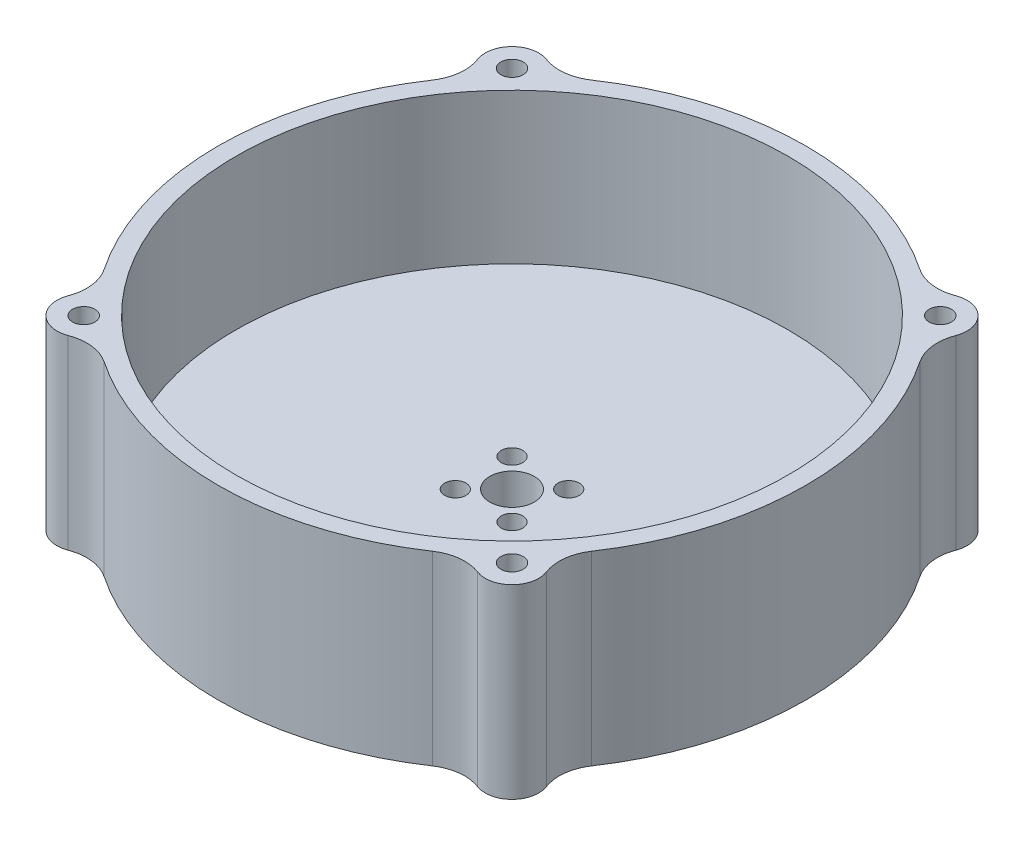
ISO-10303-21;
HEADER;
FILE_DESCRIPTION(('STEP AP214'),'2;1');
FILE_NAME('part.step','',(''),(''),'','','');
FILE_SCHEMA(('AUTOMOTIVE_DESIGN { 1 0 10303 214 1 1 1 1 }'));
ENDSEC;
DATA;
#1=APPLICATION_CONTEXT('core data for automotive mechanical design processes');
#2=APPLICATION_PROTOCOL_DEFINITION('international standard','automotive_design',2000,#1);
#3=PRODUCT_CONTEXT('',#1,'mechanical');
#4=PRODUCT('Part','Part','',(#3));
#5=PRODUCT_RELATED_PRODUCT_CATEGORY('part','',(#4));
#6=PRODUCT_DEFINITION_FORMATION('','',#4);
#7=PRODUCT_DEFINITION_CONTEXT('part definition',#1,'design');
#8=PRODUCT_DEFINITION('design','',#6,#7);
#9=PRODUCT_DEFINITION_SHAPE('','',#8);
#10=(LENGTH_UNIT() NAMED_UNIT(*) SI_UNIT(.MILLI.,.METRE.));
#11=(NAMED_UNIT(*) PLANE_ANGLE_UNIT() SI_UNIT($,.RADIAN.));
#12=(NAMED_UNIT(*) SI_UNIT($,.STERADIAN.) SOLID_ANGLE_UNIT());
#13=UNCERTAINTY_MEASURE_WITH_UNIT(LENGTH_MEASURE(1.E-05),#10,'distance_accuracy_value','');
#14=(GEOMETRIC_REPRESENTATION_CONTEXT(3) GLOBAL_UNCERTAINTY_ASSIGNED_CONTEXT((#13)) GLOBAL_UNIT_ASSIGNED_CONTEXT((#10,
#11,#12)) REPRESENTATION_CONTEXT('',''));
#15=CARTESIAN_POINT('',(0.,0.,0.));
#16=DIRECTION('',(0.,0.,1.));
#17=DIRECTION('',(1.,0.,0.));
#18=AXIS2_PLACEMENT_3D('',#15,#16,#17);
#19=CARTESIAN_POINT('',(0.,4.,0.));
#20=DIRECTION('',(0.,-1.,0.));
#21=DIRECTION('',(0.,0.,-1.));
#22=AXIS2_PLACEMENT_3D('',#19,#20,#21);
#23=CYLINDRICAL_SURFACE('',#22,33.);
#24=CARTESIAN_POINT('',(0.,0.,0.));
#25=DIRECTION('',(0.,1.,0.));
#26=DIRECTION('',(0.,0.,1.));
#27=AXIS2_PLACEMENT_3D('',#24,#25,#26);
#28=CIRCLE('',#27,33.);
#29=CARTESIAN_POINT('',(18.4243234866216,0.,-27.3778067795856));
#30=VERTEX_POINT('',#29);
#31=CARTESIAN_POINT('',(-18.4243234866216,0.,-27.3778067795856));
#32=VERTEX_POINT('',#31);
#33=EDGE_CURVE('E313',#30,#32,#28,.T.);
#34=ORIENTED_EDGE('',*,*,#33,.T.);
#35=DIRECTION('',(0.,-1.,0.));
#36=VECTOR('',#35,1.);
#37=CARTESIAN_POINT('',(-18.4243234866217,4.,-27.3778067795856));
#38=LINE('',#37,#36);
#39=CARTESIAN_POINT('',(-18.4243234866216,20.88,-27.3778067795856));
#40=VERTEX_POINT('',#39);
#41=EDGE_CURVE('E391',#32,#40,#38,.F.);
#42=ORIENTED_EDGE('',*,*,#41,.T.);
#43=CARTESIAN_POINT('',(0.,20.88,0.));
#44=DIRECTION('',(0.,1.,0.));
#45=DIRECTION('',(0.,0.,1.));
#46=AXIS2_PLACEMENT_3D('',#43,#44,#45);
#47=CIRCLE('',#46,33.);
#48=CARTESIAN_POINT('',(18.4243234866216,20.88,-27.3778067795856));
#49=VERTEX_POINT('',#48);
#50=EDGE_CURVE('E308',#49,#40,#47,.T.);
#51=ORIENTED_EDGE('',*,*,#50,.F.);
#52=DIRECTION('',(0.,-1.,0.));
#53=VECTOR('',#52,1.);
#54=CARTESIAN_POINT('',(18.4243234866216,4.,-27.3778067795856));
#55=LINE('',#54,#53);
#56=EDGE_CURVE('E330',#49,#30,#55,.T.);
#57=ORIENTED_EDGE('',*,*,#56,.T.);
#58=EDGE_LOOP('',(#34,#42,#51,#57));
#59=FACE_BOUND('',#58,.T.);
#60=ADVANCED_FACE('F46',(#59),#23,.T.);
#61=CARTESIAN_POINT('',(-27.3778067795854,20.88,-18.4243234866219));
#62=VERTEX_POINT('',#61);
#63=CARTESIAN_POINT('',(-27.3778067795854,20.88,18.4243234866219));
#64=VERTEX_POINT('',#63);
#65=EDGE_CURVE('E312',#62,#64,#47,.T.);
#66=ORIENTED_EDGE('',*,*,#65,.F.);
#67=DIRECTION('',(0.,-1.,0.));
#68=VECTOR('',#67,1.);
#69=CARTESIAN_POINT('',(-27.3778067795854,4.,-18.4243234866219));
#70=LINE('',#69,#68);
#71=CARTESIAN_POINT('',(-27.3778067795854,0.,-18.4243234866219));
#72=VERTEX_POINT('',#71);
#73=EDGE_CURVE('E384',#62,#72,#70,.T.);
#74=ORIENTED_EDGE('',*,*,#73,.T.);
#75=CARTESIAN_POINT('',(-27.3778067795854,0.,18.4243234866219));
#76=VERTEX_POINT('',#75);
#77=EDGE_CURVE('E316',#72,#76,#28,.T.);
#78=ORIENTED_EDGE('',*,*,#77,.T.);
#79=DIRECTION('',(0.,-1.,0.));
#80=VECTOR('',#79,1.);
#81=CARTESIAN_POINT('',(-27.3778067795854,4.,18.4243234866219));
#82=LINE('',#81,#80);
#83=EDGE_CURVE('E372',#76,#64,#82,.F.);
#84=ORIENTED_EDGE('',*,*,#83,.T.);
#85=EDGE_LOOP('',(#66,#74,#78,#84));
#86=FACE_BOUND('',#85,.T.);
#87=ADVANCED_FACE('F431',(#86),#23,.T.);
#88=CARTESIAN_POINT('',(-18.4243234866216,20.88,27.3778067795856));
#89=VERTEX_POINT('',#88);
#90=CARTESIAN_POINT('',(18.4243234866218,20.88,27.3778067795854));
#91=VERTEX_POINT('',#90);
#92=EDGE_CURVE('E449',#89,#91,#47,.T.);
#93=ORIENTED_EDGE('',*,*,#92,.F.);
#94=DIRECTION('',(0.,-1.,0.));
#95=VECTOR('',#94,1.);
#96=CARTESIAN_POINT('',(-18.4243234866216,4.,27.3778067795856));
#97=LINE('',#96,#95);
#98=CARTESIAN_POINT('',(-18.4243234866216,0.,27.3778067795856));
#99=VERTEX_POINT('',#98);
#100=EDGE_CURVE('E365',#89,#99,#97,.T.);
#101=ORIENTED_EDGE('',*,*,#100,.T.);
#102=CARTESIAN_POINT('',(18.4243234866218,0.,27.3778067795854));
#103=VERTEX_POINT('',#102);
#104=EDGE_CURVE('E426',#99,#103,#28,.T.);
#105=ORIENTED_EDGE('',*,*,#104,.T.);
#106=DIRECTION('',(0.,-1.,0.));
#107=VECTOR('',#106,1.);
#108=CARTESIAN_POINT('',(18.4243234866218,4.,27.3778067795854));
#109=LINE('',#108,#107);
#110=EDGE_CURVE('E353',#103,#91,#109,.F.);
#111=ORIENTED_EDGE('',*,*,#110,.T.);
#112=EDGE_LOOP('',(#93,#101,#105,#111));
#113=FACE_BOUND('',#112,.T.);
#114=ADVANCED_FACE('F451',(#113),#23,.T.);
#115=CARTESIAN_POINT('',(27.3778067795855,20.88,18.4243234866217));
#116=VERTEX_POINT('',#115);
#117=CARTESIAN_POINT('',(27.3778067795854,20.88,-18.4243234866219));
#118=VERTEX_POINT('',#117);
#119=EDGE_CURVE('E307',#116,#118,#47,.T.);
#120=ORIENTED_EDGE('',*,*,#119,.F.);
#121=DIRECTION('',(0.,-1.,0.));
#122=VECTOR('',#121,1.);
#123=CARTESIAN_POINT('',(27.3778067795855,4.,18.4243234866217));
#124=LINE('',#123,#122);
#125=CARTESIAN_POINT('',(27.3778067795855,0.,18.4243234866217));
#126=VERTEX_POINT('',#125);
#127=EDGE_CURVE('E346',#116,#126,#124,.T.);
#128=ORIENTED_EDGE('',*,*,#127,.T.);
#129=CARTESIAN_POINT('',(27.3778067795854,0.,-18.4243234866219));
#130=VERTEX_POINT('',#129);
#131=EDGE_CURVE('E311',#126,#130,#28,.T.);
#132=ORIENTED_EDGE('',*,*,#131,.T.);
#133=DIRECTION('',(0.,-1.,0.));
#134=VECTOR('',#133,1.);
#135=CARTESIAN_POINT('',(27.3778067795854,4.,-18.4243234866219));
#136=LINE('',#135,#134);
#137=EDGE_CURVE('E319',#130,#118,#136,.F.);
#138=ORIENTED_EDGE('',*,*,#137,.T.);
#139=EDGE_LOOP('',(#120,#128,#132,#138));
#140=FACE_BOUND('',#139,.T.);
#141=ADVANCED_FACE('F456',(#140),#23,.T.);
#142=CARTESIAN_POINT('',(0.,0.,0.));
#143=DIRECTION('',(0.,1.,0.));
#144=DIRECTION('',(0.,0.,1.));
#145=AXIS2_PLACEMENT_3D('',#142,#143,#144);
#146=PLANE('',#145);
#147=DIRECTION('',(0.,0.,1.));
#148=VECTOR('',#147,1.);
#149=CARTESIAN_POINT('',(13.5,0.,4.));
#150=LINE('',#149,#148);
#151=CARTESIAN_POINT('',(13.5,0.,-4.));
#152=VERTEX_POINT('',#151);
#153=CARTESIAN_POINT('',(13.5,0.,4.));
#154=VERTEX_POINT('',#153);
#155=EDGE_CURVE('E261',#152,#154,#150,.T.);
#156=ORIENTED_EDGE('',*,*,#155,.T.);
#157=CARTESIAN_POINT('',(15.,0.,4.));
#158=DIRECTION('',(0.,1.,0.));
#159=DIRECTION('',(0.,0.,1.));
#160=AXIS2_PLACEMENT_3D('',#157,#158,#159);
#161=CIRCLE('',#160,1.5);
#162=CARTESIAN_POINT('',(16.5,0.,4.));
#163=VERTEX_POINT('',#162);
#164=EDGE_CURVE('E251',#154,#163,#161,.T.);
#165=ORIENTED_EDGE('',*,*,#164,.T.);
#166=DIRECTION('',(0.,0.,-1.));
#167=VECTOR('',#166,1.);
#168=CARTESIAN_POINT('',(16.5,0.,4.));
#169=LINE('',#168,#167);
#170=CARTESIAN_POINT('',(16.5,0.,-4.));
#171=VERTEX_POINT('',#170);
#172=EDGE_CURVE('E254',#163,#171,#169,.T.);
#173=ORIENTED_EDGE('',*,*,#172,.T.);
#174=CARTESIAN_POINT('',(15.,0.,-4.));
#175=DIRECTION('',(0.,1.,0.));
#176=DIRECTION('',(0.,0.,1.));
#177=AXIS2_PLACEMENT_3D('',#174,#175,#176);
#178=CIRCLE('',#177,1.5);
#179=EDGE_CURVE('E258',#171,#152,#178,.T.);
#180=ORIENTED_EDGE('',*,*,#179,.T.);
#181=EDGE_LOOP('',(#156,#165,#173,#180));
#182=FACE_BOUND('',#181,.T.);
#183=CARTESIAN_POINT('',(0.,0.,0.));
#184=DIRECTION('',(0.,1.,0.));
#185=DIRECTION('',(0.,0.,1.));
#186=AXIS2_PLACEMENT_3D('',#183,#184,#185);
#187=CIRCLE('',#186,2.5);
#188=CARTESIAN_POINT('',(0.,0.,2.5));
#189=VERTEX_POINT('',#188);
#190=EDGE_CURVE('E283',#189,#189,#187,.T.);
#191=ORIENTED_EDGE('',*,*,#190,.T.);
#192=EDGE_LOOP('',(#191));
#193=FACE_BOUND('',#192,.T.);
#194=CARTESIAN_POINT('',(-3.18198051533946,0.,-3.18198051533946));
#195=DIRECTION('',(0.,-1.,0.));
#196=DIRECTION('',(0.,0.,-1.));
#197=AXIS2_PLACEMENT_3D('',#194,#195,#196);
#198=CIRCLE('',#197,1.2);
#199=CARTESIAN_POINT('',(-3.18198051533946,0.,-4.38198051533946));
#200=VERTEX_POINT('',#199);
#201=EDGE_CURVE('E286',#200,#200,#198,.T.);
#202=ORIENTED_EDGE('',*,*,#201,.F.);
#203=EDGE_LOOP('',(#202));
#204=FACE_BOUND('',#203,.T.);
#205=CARTESIAN_POINT('',(-3.18198051533946,0.,3.18198051533946));
#206=DIRECTION('',(0.,-1.,0.));
#207=DIRECTION('',(0.,0.,-1.));
#208=AXIS2_PLACEMENT_3D('',#205,#206,#207);
#209=CIRCLE('',#208,1.2);
#210=CARTESIAN_POINT('',(-3.18198051533946,0.,1.98198051533947));
#211=VERTEX_POINT('',#210);
#212=EDGE_CURVE('E292',#211,#211,#209,.T.);
#213=ORIENTED_EDGE('',*,*,#212,.F.);
#214=EDGE_LOOP('',(#213));
#215=FACE_BOUND('',#214,.T.);
#216=CARTESIAN_POINT('',(3.18198051533946,0.,3.18198051533946));
#217=DIRECTION('',(0.,-1.,0.));
#218=DIRECTION('',(0.,0.,-1.));
#219=AXIS2_PLACEMENT_3D('',#216,#217,#218);
#220=CIRCLE('',#219,1.2);
#221=CARTESIAN_POINT('',(3.18198051533946,0.,1.98198051533947));
#222=VERTEX_POINT('',#221);
#223=EDGE_CURVE('E296',#222,#222,#220,.T.);
#224=ORIENTED_EDGE('',*,*,#223,.F.);
#225=EDGE_LOOP('',(#224));
#226=FACE_BOUND('',#225,.T.);
#227=CARTESIAN_POINT('',(3.18198051533946,0.,-3.18198051533946));
#228=DIRECTION('',(0.,-1.,0.));
#229=DIRECTION('',(0.,0.,-1.));
#230=AXIS2_PLACEMENT_3D('',#227,#228,#229);
#231=CIRCLE('',#230,1.2);
#232=CARTESIAN_POINT('',(3.18198051533946,0.,-4.38198051533946));
#233=VERTEX_POINT('',#232);
#234=EDGE_CURVE('E300',#233,#233,#231,.T.);
#235=ORIENTED_EDGE('',*,*,#234,.F.);
#236=EDGE_LOOP('',(#235));
#237=FACE_BOUND('',#236,.T.);
#238=ORIENTED_EDGE('',*,*,#77,.F.);
#239=CARTESIAN_POINT('',(-31.5259593219468,0.,-21.2158876512616));
#240=DIRECTION('',(0.,1.,0.));
#241=DIRECTION('',(0.,0.,1.));
#242=AXIS2_PLACEMENT_3D('',#239,#240,#241);
#243=CIRCLE('',#242,5.);
#244=CARTESIAN_POINT('',(-26.8482538459441,0.,-22.9819769694373));
#245=VERTEX_POINT('',#244);
#246=EDGE_CURVE('E393',#72,#245,#243,.T.);
#247=ORIENTED_EDGE('',*,*,#246,.T.);
#248=CARTESIAN_POINT('',(-24.0416305603425,0.,-24.0416305603427));
#249=DIRECTION('',(0.,1.,0.));
#250=DIRECTION('',(1.,0.,0.));
#251=AXIS2_PLACEMENT_3D('',#248,#249,#250);
#252=CIRCLE('',#251,3.);
#253=CARTESIAN_POINT('',(-22.981976969437,0.,-26.8482538459443));
#254=VERTEX_POINT('',#253);
#255=EDGE_CURVE('E227',#254,#245,#252,.T.);
#256=ORIENTED_EDGE('',*,*,#255,.F.);
#257=CARTESIAN_POINT('',(-21.2158876512613,0.,-31.525959321947));
#258=DIRECTION('',(0.,1.,0.));
#259=DIRECTION('',(0.,0.,1.));
#260=AXIS2_PLACEMENT_3D('',#257,#258,#259);
#261=CIRCLE('',#260,5.);
#262=EDGE_CURVE('E11',#254,#32,#261,.T.);
#263=ORIENTED_EDGE('',*,*,#262,.T.);
#264=ORIENTED_EDGE('',*,*,#33,.F.);
#265=CARTESIAN_POINT('',(21.2158876512613,0.,-31.525959321947));
#266=DIRECTION('',(0.,1.,0.));
#267=DIRECTION('',(0.,0.,1.));
#268=AXIS2_PLACEMENT_3D('',#265,#266,#267);
#269=CIRCLE('',#268,5.);
#270=CARTESIAN_POINT('',(22.981976969437,0.,-26.8482538459444));
#271=VERTEX_POINT('',#270);
#272=EDGE_CURVE('E337',#30,#271,#269,.T.);
#273=ORIENTED_EDGE('',*,*,#272,.T.);
#274=CARTESIAN_POINT('',(24.0416305603425,0.,-24.0416305603427));
#275=DIRECTION('',(0.,1.,0.));
#276=DIRECTION('',(0.,0.,1.));
#277=AXIS2_PLACEMENT_3D('',#274,#275,#276);
#278=CIRCLE('',#277,3.);
#279=CARTESIAN_POINT('',(26.8482538459441,0.,-22.9819769694373));
#280=VERTEX_POINT('',#279);
#281=EDGE_CURVE('E245',#280,#271,#278,.T.);
#282=ORIENTED_EDGE('',*,*,#281,.F.);
#283=CARTESIAN_POINT('',(31.5259593219468,0.,-21.2158876512616));
#284=DIRECTION('',(0.,1.,0.));
#285=DIRECTION('',(0.,0.,1.));
#286=AXIS2_PLACEMENT_3D('',#283,#284,#285);
#287=CIRCLE('',#286,5.);
#288=EDGE_CURVE('E343',#280,#130,#287,.T.);
#289=ORIENTED_EDGE('',*,*,#288,.T.);
#290=ORIENTED_EDGE('',*,*,#131,.F.);
#291=CARTESIAN_POINT('',(31.525959321947,0.,21.2158876512614));
#292=DIRECTION('',(0.,1.,0.));
#293=DIRECTION('',(0.,0.,1.));
#294=AXIS2_PLACEMENT_3D('',#291,#292,#293);
#295=CIRCLE('',#294,5.);
#296=CARTESIAN_POINT('',(26.8482538459443,0.,22.9819769694371));
#297=VERTEX_POINT('',#296);
#298=EDGE_CURVE('E356',#126,#297,#295,.T.);
#299=ORIENTED_EDGE('',*,*,#298,.T.);
#300=CARTESIAN_POINT('',(24.0416305603427,0.,24.0416305603426));
#301=DIRECTION('',(0.,1.,0.));
#302=DIRECTION('',(-1.,0.,0.));
#303=AXIS2_PLACEMENT_3D('',#300,#301,#302);
#304=CIRCLE('',#303,3.);
#305=CARTESIAN_POINT('',(22.9819769694372,0.,26.8482538459442));
#306=VERTEX_POINT('',#305);
#307=EDGE_CURVE('E239',#306,#297,#304,.T.);
#308=ORIENTED_EDGE('',*,*,#307,.F.);
#309=CARTESIAN_POINT('',(21.2158876512615,0.,31.5259593219469));
#310=DIRECTION('',(0.,1.,0.));
#311=DIRECTION('',(0.,0.,1.));
#312=AXIS2_PLACEMENT_3D('',#309,#310,#311);
#313=CIRCLE('',#312,5.);
#314=EDGE_CURVE('E362',#306,#103,#313,.T.);
#315=ORIENTED_EDGE('',*,*,#314,.T.);
#316=ORIENTED_EDGE('',*,*,#104,.F.);
#317=CARTESIAN_POINT('',(-21.2158876512613,0.,31.525959321947));
#318=DIRECTION('',(0.,1.,0.));
#319=DIRECTION('',(0.,0.,1.));
#320=AXIS2_PLACEMENT_3D('',#317,#318,#319);
#321=CIRCLE('',#320,5.);
#322=CARTESIAN_POINT('',(-22.981976969437,0.,26.8482538459444));
#323=VERTEX_POINT('',#322);
#324=EDGE_CURVE('E375',#99,#323,#321,.T.);
#325=ORIENTED_EDGE('',*,*,#324,.T.);
#326=CARTESIAN_POINT('',(-24.0416305603425,0.,24.0416305603427));
#327=DIRECTION('',(0.,1.,0.));
#328=DIRECTION('',(0.,0.,-1.));
#329=AXIS2_PLACEMENT_3D('',#326,#327,#328);
#330=CIRCLE('',#329,3.);
#331=CARTESIAN_POINT('',(-26.8482538459441,0.,22.9819769694373));
#332=VERTEX_POINT('',#331);
#333=EDGE_CURVE('E233',#332,#323,#330,.T.);
#334=ORIENTED_EDGE('',*,*,#333,.F.);
#335=CARTESIAN_POINT('',(-31.5259593219468,0.,21.2158876512616));
#336=DIRECTION('',(0.,1.,0.));
#337=DIRECTION('',(0.,0.,1.));
#338=AXIS2_PLACEMENT_3D('',#335,#336,#337);
#339=CIRCLE('',#338,5.);
#340=EDGE_CURVE('E381',#332,#76,#339,.T.);
#341=ORIENTED_EDGE('',*,*,#340,.T.);
#342=EDGE_LOOP('',(#238,#247,#256,#263,#264,#273,#282,#289,#290,#299,#308,#315,#316,#325,#334,#341));
#343=FACE_BOUND('',#342,.T.);
#344=ADVANCED_FACE('F408',(#182,#193,#204,#215,#226,#237,#343),#146,.F.);
#345=CARTESIAN_POINT('',(0.,20.88,0.));
#346=DIRECTION('',(0.,1.,0.));
#347=DIRECTION('',(0.,0.,1.));
#348=AXIS2_PLACEMENT_3D('',#345,#346,#347);
#349=PLANE('',#348);
#350=CARTESIAN_POINT('',(24.0416305603427,20.88,24.0416305603426));
#351=DIRECTION('',(0.,1.,0.));
#352=DIRECTION('',(0.,0.,1.));
#353=AXIS2_PLACEMENT_3D('',#350,#351,#352);
#354=CIRCLE('',#353,1.25);
#355=CARTESIAN_POINT('',(24.0416305603427,20.88,25.2916305603426));
#356=VERTEX_POINT('',#355);
#357=EDGE_CURVE('E204',#356,#356,#354,.T.);
#358=ORIENTED_EDGE('',*,*,#357,.F.);
#359=EDGE_LOOP('',(#358));
#360=FACE_BOUND('',#359,.T.);
#361=CARTESIAN_POINT('',(-24.0416305603425,20.88,24.0416305603427));
#362=DIRECTION('',(0.,1.,0.));
#363=DIRECTION('',(0.,0.,1.));
#364=AXIS2_PLACEMENT_3D('',#361,#362,#363);
#365=CIRCLE('',#364,1.25);
#366=CARTESIAN_POINT('',(-24.0416305603425,20.88,25.2916305603427));
#367=VERTEX_POINT('',#366);
#368=EDGE_CURVE('E203',#367,#367,#365,.T.);
#369=ORIENTED_EDGE('',*,*,#368,.F.);
#370=EDGE_LOOP('',(#369));
#371=FACE_BOUND('',#370,.T.);
#372=CARTESIAN_POINT('',(-24.0416305603425,20.88,-24.0416305603427));
#373=DIRECTION('',(0.,1.,0.));
#374=DIRECTION('',(0.,0.,1.));
#375=AXIS2_PLACEMENT_3D('',#372,#373,#374);
#376=CIRCLE('',#375,1.25);
#377=CARTESIAN_POINT('',(-24.0416305603425,20.88,-22.7916305603427));
#378=VERTEX_POINT('',#377);
#379=EDGE_CURVE('E214',#378,#378,#376,.T.);
#380=ORIENTED_EDGE('',*,*,#379,.F.);
#381=EDGE_LOOP('',(#380));
#382=FACE_BOUND('',#381,.T.);
#383=CARTESIAN_POINT('',(24.0416305603425,20.88,-24.0416305603427));
#384=DIRECTION('',(0.,1.,0.));
#385=DIRECTION('',(0.,0.,1.));
#386=AXIS2_PLACEMENT_3D('',#383,#384,#385);
#387=CIRCLE('',#386,1.25);
#388=CARTESIAN_POINT('',(24.0416305603425,20.88,-22.7916305603427));
#389=VERTEX_POINT('',#388);
#390=EDGE_CURVE('E220',#389,#389,#387,.T.);
#391=ORIENTED_EDGE('',*,*,#390,.F.);
#392=EDGE_LOOP('',(#391));
#393=FACE_BOUND('',#392,.T.);
#394=ORIENTED_EDGE('',*,*,#50,.T.);
#395=CARTESIAN_POINT('',(-21.2158876512613,20.88,-31.525959321947));
#396=DIRECTION('',(0.,1.,0.));
#397=DIRECTION('',(0.,0.,1.));
#398=AXIS2_PLACEMENT_3D('',#395,#396,#397);
#399=CIRCLE('',#398,5.);
#400=CARTESIAN_POINT('',(-22.981976969437,20.88,-26.8482538459443));
#401=VERTEX_POINT('',#400);
#402=EDGE_CURVE('E54',#40,#401,#399,.F.);
#403=ORIENTED_EDGE('',*,*,#402,.T.);
#404=CARTESIAN_POINT('',(-24.0416305603425,20.88,-24.0416305603427));
#405=DIRECTION('',(0.,1.,0.));
#406=DIRECTION('',(1.,0.,0.));
#407=AXIS2_PLACEMENT_3D('',#404,#405,#406);
#408=CIRCLE('',#407,3.);
#409=CARTESIAN_POINT('',(-26.8482538459441,20.88,-22.9819769694373));
#410=VERTEX_POINT('',#409);
#411=EDGE_CURVE('E226',#401,#410,#408,.T.);
#412=ORIENTED_EDGE('',*,*,#411,.T.);
#413=CARTESIAN_POINT('',(-31.5259593219468,20.88,-21.2158876512616));
#414=DIRECTION('',(0.,1.,0.));
#415=DIRECTION('',(0.,0.,1.));
#416=AXIS2_PLACEMENT_3D('',#413,#414,#415);
#417=CIRCLE('',#416,5.);
#418=EDGE_CURVE('E395',#410,#62,#417,.F.);
#419=ORIENTED_EDGE('',*,*,#418,.T.);
#420=ORIENTED_EDGE('',*,*,#65,.T.);
#421=CARTESIAN_POINT('',(-31.5259593219468,20.88,21.2158876512616));
#422=DIRECTION('',(0.,1.,0.));
#423=DIRECTION('',(0.,0.,1.));
#424=AXIS2_PLACEMENT_3D('',#421,#422,#423);
#425=CIRCLE('',#424,5.);
#426=CARTESIAN_POINT('',(-26.8482538459441,20.88,22.9819769694373));
#427=VERTEX_POINT('',#426);
#428=EDGE_CURVE('E379',#64,#427,#425,.F.);
#429=ORIENTED_EDGE('',*,*,#428,.T.);
#430=CARTESIAN_POINT('',(-24.0416305603425,20.88,24.0416305603427));
#431=DIRECTION('',(0.,1.,0.));
#432=DIRECTION('',(0.,0.,-1.));
#433=AXIS2_PLACEMENT_3D('',#430,#431,#432);
#434=CIRCLE('',#433,3.);
#435=CARTESIAN_POINT('',(-22.981976969437,20.88,26.8482538459444));
#436=VERTEX_POINT('',#435);
#437=EDGE_CURVE('E230',#427,#436,#434,.T.);
#438=ORIENTED_EDGE('',*,*,#437,.T.);
#439=CARTESIAN_POINT('',(-21.2158876512613,20.88,31.525959321947));
#440=DIRECTION('',(0.,1.,0.));
#441=DIRECTION('',(0.,0.,1.));
#442=AXIS2_PLACEMENT_3D('',#439,#440,#441);
#443=CIRCLE('',#442,5.);
#444=EDGE_CURVE('E377',#436,#89,#443,.F.);
#445=ORIENTED_EDGE('',*,*,#444,.T.);
#446=ORIENTED_EDGE('',*,*,#92,.T.);
#447=CARTESIAN_POINT('',(21.2158876512615,20.88,31.5259593219469));
#448=DIRECTION('',(0.,1.,0.));
#449=DIRECTION('',(0.,0.,1.));
#450=AXIS2_PLACEMENT_3D('',#447,#448,#449);
#451=CIRCLE('',#450,5.);
#452=CARTESIAN_POINT('',(22.9819769694372,20.88,26.8482538459442));
#453=VERTEX_POINT('',#452);
#454=EDGE_CURVE('E360',#91,#453,#451,.F.);
#455=ORIENTED_EDGE('',*,*,#454,.T.);
#456=CARTESIAN_POINT('',(24.0416305603427,20.88,24.0416305603426));
#457=DIRECTION('',(0.,1.,0.));
#458=DIRECTION('',(-1.,0.,0.));
#459=AXIS2_PLACEMENT_3D('',#456,#457,#458);
#460=CIRCLE('',#459,3.);
#461=CARTESIAN_POINT('',(26.8482538459443,20.88,22.9819769694371));
#462=VERTEX_POINT('',#461);
#463=EDGE_CURVE('E236',#453,#462,#460,.T.);
#464=ORIENTED_EDGE('',*,*,#463,.T.);
#465=CARTESIAN_POINT('',(31.525959321947,20.88,21.2158876512614));
#466=DIRECTION('',(0.,1.,0.));
#467=DIRECTION('',(0.,0.,1.));
#468=AXIS2_PLACEMENT_3D('',#465,#466,#467);
#469=CIRCLE('',#468,5.);
#470=EDGE_CURVE('E358',#462,#116,#469,.F.);
#471=ORIENTED_EDGE('',*,*,#470,.T.);
#472=ORIENTED_EDGE('',*,*,#119,.T.);
#473=CARTESIAN_POINT('',(31.5259593219468,20.88,-21.2158876512616));
#474=DIRECTION('',(0.,1.,0.));
#475=DIRECTION('',(0.,0.,1.));
#476=AXIS2_PLACEMENT_3D('',#473,#474,#475);
#477=CIRCLE('',#476,5.);
#478=CARTESIAN_POINT('',(26.8482538459441,20.88,-22.9819769694373));
#479=VERTEX_POINT('',#478);
#480=EDGE_CURVE('E341',#118,#479,#477,.F.);
#481=ORIENTED_EDGE('',*,*,#480,.T.);
#482=CARTESIAN_POINT('',(24.0416305603425,20.88,-24.0416305603427));
#483=DIRECTION('',(0.,1.,0.));
#484=DIRECTION('',(0.,0.,1.));
#485=AXIS2_PLACEMENT_3D('',#482,#483,#484);
#486=CIRCLE('',#485,3.);
#487=CARTESIAN_POINT('',(22.981976969437,20.88,-26.8482538459444));
#488=VERTEX_POINT('',#487);
#489=EDGE_CURVE('E242',#479,#488,#486,.T.);
#490=ORIENTED_EDGE('',*,*,#489,.T.);
#491=CARTESIAN_POINT('',(21.2158876512613,20.88,-31.525959321947));
#492=DIRECTION('',(0.,1.,0.));
#493=DIRECTION('',(0.,0.,1.));
#494=AXIS2_PLACEMENT_3D('',#491,#492,#493);
#495=CIRCLE('',#494,5.);
#496=EDGE_CURVE('E339',#488,#49,#495,.F.);
#497=ORIENTED_EDGE('',*,*,#496,.T.);
#498=EDGE_LOOP('',(#394,#403,#412,#419,#420,#429,#438,#445,#446,#455,#464,#471,#472,#481,#490,#497));
#499=FACE_BOUND('',#498,.T.);
#500=CARTESIAN_POINT('',(0.,20.88,0.));
#501=DIRECTION('',(0.,1.,0.));
#502=DIRECTION('',(0.,0.,1.));
#503=AXIS2_PLACEMENT_3D('',#500,#501,#502);
#504=CIRCLE('',#503,31.);
#505=CARTESIAN_POINT('',(0.,20.88,31.));
#506=VERTEX_POINT('',#505);
#507=EDGE_CURVE('E304',#506,#506,#504,.T.);
#508=ORIENTED_EDGE('',*,*,#507,.F.);
#509=EDGE_LOOP('',(#508));
#510=FACE_BOUND('',#509,.T.);
#511=ADVANCED_FACE('F398',(#360,#371,#382,#393,#499,#510),#349,.T.);
#512=CARTESIAN_POINT('',(0.,20.88,0.));
#513=DIRECTION('',(0.,-1.,0.));
#514=DIRECTION('',(0.,0.,-1.));
#515=AXIS2_PLACEMENT_3D('',#512,#513,#514);
#516=CYLINDRICAL_SURFACE('',#515,31.);
#517=ORIENTED_EDGE('',*,*,#507,.T.);
#518=EDGE_LOOP('',(#517));
#519=FACE_BOUND('',#518,.T.);
#520=CARTESIAN_POINT('',(0.,4.,0.));
#521=DIRECTION('',(0.,1.,0.));
#522=DIRECTION('',(0.,0.,1.));
#523=AXIS2_PLACEMENT_3D('',#520,#521,#522);
#524=CIRCLE('',#523,31.);
#525=CARTESIAN_POINT('',(0.,4.,31.));
#526=VERTEX_POINT('',#525);
#527=EDGE_CURVE('E315',#526,#526,#524,.F.);
#528=ORIENTED_EDGE('',*,*,#527,.T.);
#529=EDGE_LOOP('',(#528));
#530=FACE_BOUND('',#529,.T.);
#531=ADVANCED_FACE('F641',(#519,#530),#516,.F.);
#532=CARTESIAN_POINT('',(0.,4.,0.));
#533=DIRECTION('',(0.,1.,0.));
#534=DIRECTION('',(0.,0.,1.));
#535=AXIS2_PLACEMENT_3D('',#532,#533,#534);
#536=PLANE('',#535);
#537=CARTESIAN_POINT('',(15.,4.,4.));
#538=DIRECTION('',(0.,1.,0.));
#539=DIRECTION('',(0.,0.,1.));
#540=AXIS2_PLACEMENT_3D('',#537,#538,#539);
#541=CIRCLE('',#540,1.5);
#542=CARTESIAN_POINT('',(13.5,4.,4.));
#543=VERTEX_POINT('',#542);
#544=CARTESIAN_POINT('',(16.5,4.,4.));
#545=VERTEX_POINT('',#544);
#546=EDGE_CURVE('E248',#543,#545,#541,.T.);
#547=ORIENTED_EDGE('',*,*,#546,.F.);
#548=DIRECTION('',(0.,0.,1.));
#549=VECTOR('',#548,1.);
#550=CARTESIAN_POINT('',(13.5,4.,4.));
#551=LINE('',#550,#549);
#552=CARTESIAN_POINT('',(13.5,4.,-4.));
#553=VERTEX_POINT('',#552);
#554=EDGE_CURVE('E255',#553,#543,#551,.T.);
#555=ORIENTED_EDGE('',*,*,#554,.F.);
#556=CARTESIAN_POINT('',(15.,4.,-4.));
#557=DIRECTION('',(0.,1.,0.));
#558=DIRECTION('',(0.,0.,1.));
#559=AXIS2_PLACEMENT_3D('',#556,#557,#558);
#560=CIRCLE('',#559,1.5);
#561=CARTESIAN_POINT('',(16.5,4.,-4.));
#562=VERTEX_POINT('',#561);
#563=EDGE_CURVE('E269',#562,#553,#560,.T.);
#564=ORIENTED_EDGE('',*,*,#563,.F.);
#565=DIRECTION('',(0.,0.,-1.));
#566=VECTOR('',#565,1.);
#567=CARTESIAN_POINT('',(16.5,4.,4.));
#568=LINE('',#567,#566);
#569=EDGE_CURVE('E266',#545,#562,#568,.T.);
#570=ORIENTED_EDGE('',*,*,#569,.F.);
#571=EDGE_LOOP('',(#547,#555,#564,#570));
#572=FACE_BOUND('',#571,.T.);
#573=CARTESIAN_POINT('',(0.,4.,0.));
#574=DIRECTION('',(0.,1.,0.));
#575=DIRECTION('',(0.,0.,1.));
#576=AXIS2_PLACEMENT_3D('',#573,#574,#575);
#577=CIRCLE('',#576,2.5);
#578=CARTESIAN_POINT('',(0.,4.,2.5));
#579=VERTEX_POINT('',#578);
#580=EDGE_CURVE('E276',#579,#579,#577,.T.);
#581=ORIENTED_EDGE('',*,*,#580,.F.);
#582=EDGE_LOOP('',(#581));
#583=FACE_BOUND('',#582,.T.);
#584=CARTESIAN_POINT('',(-3.18198051533946,4.,-3.18198051533946));
#585=DIRECTION('',(0.,1.,0.));
#586=DIRECTION('',(0.,0.,1.));
#587=AXIS2_PLACEMENT_3D('',#584,#585,#586);
#588=CIRCLE('',#587,1.2);
#589=CARTESIAN_POINT('',(-3.18198051533946,4.,-1.98198051533947));
#590=VERTEX_POINT('',#589);
#591=EDGE_CURVE('E291',#590,#590,#588,.T.);
#592=ORIENTED_EDGE('',*,*,#591,.F.);
#593=EDGE_LOOP('',(#592));
#594=FACE_BOUND('',#593,.T.);
#595=CARTESIAN_POINT('',(-3.18198051533946,4.,3.18198051533946));
#596=DIRECTION('',(0.,1.,0.));
#597=DIRECTION('',(0.,0.,1.));
#598=AXIS2_PLACEMENT_3D('',#595,#596,#597);
#599=CIRCLE('',#598,1.2);
#600=CARTESIAN_POINT('',(-3.18198051533946,4.,4.38198051533946));
#601=VERTEX_POINT('',#600);
#602=EDGE_CURVE('E295',#601,#601,#599,.T.);
#603=ORIENTED_EDGE('',*,*,#602,.F.);
#604=EDGE_LOOP('',(#603));
#605=FACE_BOUND('',#604,.T.);
#606=CARTESIAN_POINT('',(3.18198051533946,4.,3.18198051533946));
#607=DIRECTION('',(0.,1.,0.));
#608=DIRECTION('',(0.,0.,1.));
#609=AXIS2_PLACEMENT_3D('',#606,#607,#608);
#610=CIRCLE('',#609,1.2);
#611=CARTESIAN_POINT('',(3.18198051533946,4.,4.38198051533946));
#612=VERTEX_POINT('',#611);
#613=EDGE_CURVE('E299',#612,#612,#610,.T.);
#614=ORIENTED_EDGE('',*,*,#613,.F.);
#615=EDGE_LOOP('',(#614));
#616=FACE_BOUND('',#615,.T.);
#617=CARTESIAN_POINT('',(3.18198051533946,4.,-3.18198051533946));
#618=DIRECTION('',(0.,1.,0.));
#619=DIRECTION('',(0.,0.,1.));
#620=AXIS2_PLACEMENT_3D('',#617,#618,#619);
#621=CIRCLE('',#620,1.2);
#622=CARTESIAN_POINT('',(3.18198051533946,4.,-1.98198051533947));
#623=VERTEX_POINT('',#622);
#624=EDGE_CURVE('E303',#623,#623,#621,.T.);
#625=ORIENTED_EDGE('',*,*,#624,.F.);
#626=EDGE_LOOP('',(#625));
#627=FACE_BOUND('',#626,.T.);
#628=ORIENTED_EDGE('',*,*,#527,.F.);
#629=EDGE_LOOP('',(#628));
#630=FACE_BOUND('',#629,.T.);
#631=ADVANCED_FACE('F629',(#572,#583,#594,#605,#616,#627,#630),#536,.T.);
#632=CARTESIAN_POINT('',(3.18198051533946,0.,-3.18198051533946));
#633=DIRECTION('',(0.,-1.,0.));
#634=DIRECTION('',(0.,0.,-1.));
#635=AXIS2_PLACEMENT_3D('',#632,#633,#634);
#636=CYLINDRICAL_SURFACE('',#635,1.2);
#637=ORIENTED_EDGE('',*,*,#624,.T.);
#638=EDGE_LOOP('',(#637));
#639=FACE_BOUND('',#638,.T.);
#640=ORIENTED_EDGE('',*,*,#234,.T.);
#641=EDGE_LOOP('',(#640));
#642=FACE_BOUND('',#641,.T.);
#643=ADVANCED_FACE('F619',(#639,#642),#636,.F.);
#644=CARTESIAN_POINT('',(3.18198051533946,0.,3.18198051533946));
#645=DIRECTION('',(0.,-1.,0.));
#646=DIRECTION('',(0.,0.,-1.));
#647=AXIS2_PLACEMENT_3D('',#644,#645,#646);
#648=CYLINDRICAL_SURFACE('',#647,1.2);
#649=ORIENTED_EDGE('',*,*,#613,.T.);
#650=EDGE_LOOP('',(#649));
#651=FACE_BOUND('',#650,.T.);
#652=ORIENTED_EDGE('',*,*,#223,.T.);
#653=EDGE_LOOP('',(#652));
#654=FACE_BOUND('',#653,.T.);
#655=ADVANCED_FACE('F608',(#651,#654),#648,.F.);
#656=CARTESIAN_POINT('',(-3.18198051533946,0.,3.18198051533946));
#657=DIRECTION('',(0.,-1.,0.));
#658=DIRECTION('',(0.,0.,-1.));
#659=AXIS2_PLACEMENT_3D('',#656,#657,#658);
#660=CYLINDRICAL_SURFACE('',#659,1.2);
#661=ORIENTED_EDGE('',*,*,#602,.T.);
#662=EDGE_LOOP('',(#661));
#663=FACE_BOUND('',#662,.T.);
#664=ORIENTED_EDGE('',*,*,#212,.T.);
#665=EDGE_LOOP('',(#664));
#666=FACE_BOUND('',#665,.T.);
#667=ADVANCED_FACE('F597',(#663,#666),#660,.F.);
#668=CARTESIAN_POINT('',(-3.18198051533946,0.,-3.18198051533946));
#669=DIRECTION('',(0.,-1.,0.));
#670=DIRECTION('',(0.,0.,-1.));
#671=AXIS2_PLACEMENT_3D('',#668,#669,#670);
#672=CYLINDRICAL_SURFACE('',#671,1.2);
#673=ORIENTED_EDGE('',*,*,#591,.T.);
#674=EDGE_LOOP('',(#673));
#675=FACE_BOUND('',#674,.T.);
#676=ORIENTED_EDGE('',*,*,#201,.T.);
#677=EDGE_LOOP('',(#676));
#678=FACE_BOUND('',#677,.T.);
#679=ADVANCED_FACE('F586',(#675,#678),#672,.F.);
#680=CARTESIAN_POINT('',(0.,0.,0.));
#681=DIRECTION('',(0.,1.,0.));
#682=DIRECTION('',(0.,0.,1.));
#683=AXIS2_PLACEMENT_3D('',#680,#681,#682);
#684=CYLINDRICAL_SURFACE('',#683,2.5);
#685=ORIENTED_EDGE('',*,*,#190,.F.);
#686=EDGE_LOOP('',(#685));
#687=FACE_BOUND('',#686,.T.);
#688=ORIENTED_EDGE('',*,*,#580,.T.);
#689=EDGE_LOOP('',(#688));
#690=FACE_BOUND('',#689,.T.);
#691=ADVANCED_FACE('F575',(#687,#690),#684,.F.);
#692=CARTESIAN_POINT('',(15.,0.,4.));
#693=DIRECTION('',(0.,1.,0.));
#694=DIRECTION('',(0.,0.,1.));
#695=AXIS2_PLACEMENT_3D('',#692,#693,#694);
#696=CYLINDRICAL_SURFACE('',#695,1.5);
#697=ORIENTED_EDGE('',*,*,#546,.T.);
#698=DIRECTION('',(0.,1.,0.));
#699=VECTOR('',#698,1.);
#700=CARTESIAN_POINT('',(16.5,0.,4.));
#701=LINE('',#700,#699);
#702=EDGE_CURVE('E264',#163,#545,#701,.T.);
#703=ORIENTED_EDGE('',*,*,#702,.F.);
#704=ORIENTED_EDGE('',*,*,#164,.F.);
#705=DIRECTION('',(0.,1.,0.));
#706=VECTOR('',#705,1.);
#707=CARTESIAN_POINT('',(13.5,0.,4.));
#708=LINE('',#707,#706);
#709=EDGE_CURVE('E274',#154,#543,#708,.T.);
#710=ORIENTED_EDGE('',*,*,#709,.T.);
#711=EDGE_LOOP('',(#697,#703,#704,#710));
#712=FACE_BOUND('',#711,.T.);
#713=ADVANCED_FACE('F564',(#712),#696,.F.);
#714=CARTESIAN_POINT('',(13.5,0.,4.));
#715=DIRECTION('',(-1.,0.,0.));
#716=DIRECTION('',(0.,0.,1.));
#717=AXIS2_PLACEMENT_3D('',#714,#715,#716);
#718=PLANE('',#717);
#719=ORIENTED_EDGE('',*,*,#554,.T.);
#720=ORIENTED_EDGE('',*,*,#709,.F.);
#721=ORIENTED_EDGE('',*,*,#155,.F.);
#722=DIRECTION('',(0.,1.,0.));
#723=VECTOR('',#722,1.);
#724=CARTESIAN_POINT('',(13.5,0.,-4.));
#725=LINE('',#724,#723);
#726=EDGE_CURVE('E277',#152,#553,#725,.T.);
#727=ORIENTED_EDGE('',*,*,#726,.T.);
#728=EDGE_LOOP('',(#719,#720,#721,#727));
#729=FACE_BOUND('',#728,.T.);
#730=ADVANCED_FACE('F553',(#729),#718,.F.);
#731=CARTESIAN_POINT('',(15.,0.,-4.));
#732=DIRECTION('',(0.,1.,0.));
#733=DIRECTION('',(0.,0.,1.));
#734=AXIS2_PLACEMENT_3D('',#731,#732,#733);
#735=CYLINDRICAL_SURFACE('',#734,1.5);
#736=ORIENTED_EDGE('',*,*,#563,.T.);
#737=ORIENTED_EDGE('',*,*,#726,.F.);
#738=ORIENTED_EDGE('',*,*,#179,.F.);
#739=DIRECTION('',(0.,1.,0.));
#740=VECTOR('',#739,1.);
#741=CARTESIAN_POINT('',(16.5,0.,-4.));
#742=LINE('',#741,#740);
#743=EDGE_CURVE('E279',#171,#562,#742,.T.);
#744=ORIENTED_EDGE('',*,*,#743,.T.);
#745=EDGE_LOOP('',(#736,#737,#738,#744));
#746=FACE_BOUND('',#745,.T.);
#747=ADVANCED_FACE('F541',(#746),#735,.F.);
#748=CARTESIAN_POINT('',(16.5,0.,4.));
#749=DIRECTION('',(1.,0.,0.));
#750=DIRECTION('',(0.,0.,-1.));
#751=AXIS2_PLACEMENT_3D('',#748,#749,#750);
#752=PLANE('',#751);
#753=ORIENTED_EDGE('',*,*,#569,.T.);
#754=ORIENTED_EDGE('',*,*,#743,.F.);
#755=ORIENTED_EDGE('',*,*,#172,.F.);
#756=ORIENTED_EDGE('',*,*,#702,.T.);
#757=EDGE_LOOP('',(#753,#754,#755,#756));
#758=FACE_BOUND('',#757,.T.);
#759=ADVANCED_FACE('F530',(#758),#752,.F.);
#760=CARTESIAN_POINT('',(24.0416305603425,0.,-24.0416305603427));
#761=DIRECTION('',(0.,1.,0.));
#762=DIRECTION('',(0.,0.,1.));
#763=AXIS2_PLACEMENT_3D('',#760,#761,#762);
#764=CYLINDRICAL_SURFACE('',#763,3.);
#765=ORIENTED_EDGE('',*,*,#281,.T.);
#766=DIRECTION('',(0.,1.,0.));
#767=VECTOR('',#766,1.);
#768=CARTESIAN_POINT('',(22.981976969437,0.,-26.8482538459444));
#769=LINE('',#768,#767);
#770=EDGE_CURVE('E335',#271,#488,#769,.T.);
#771=ORIENTED_EDGE('',*,*,#770,.T.);
#772=ORIENTED_EDGE('',*,*,#489,.F.);
#773=DIRECTION('',(0.,1.,0.));
#774=VECTOR('',#773,1.);
#775=CARTESIAN_POINT('',(26.8482538459441,0.,-22.9819769694373));
#776=LINE('',#775,#774);
#777=EDGE_CURVE('E333',#479,#280,#776,.F.);
#778=ORIENTED_EDGE('',*,*,#777,.T.);
#779=EDGE_LOOP('',(#765,#771,#772,#778));
#780=FACE_BOUND('',#779,.T.);
#781=ADVANCED_FACE('F414',(#780),#764,.T.);
#782=CARTESIAN_POINT('',(21.2158876512613,0.,-31.525959321947));
#783=DIRECTION('',(0.,1.,0.));
#784=DIRECTION('',(0.,0.,1.));
#785=AXIS2_PLACEMENT_3D('',#782,#783,#784);
#786=CYLINDRICAL_SURFACE('',#785,5.);
#787=ORIENTED_EDGE('',*,*,#496,.F.);
#788=ORIENTED_EDGE('',*,*,#770,.F.);
#789=ORIENTED_EDGE('',*,*,#272,.F.);
#790=ORIENTED_EDGE('',*,*,#56,.F.);
#791=EDGE_LOOP('',(#787,#788,#789,#790));
#792=FACE_BOUND('',#791,.T.);
#793=ADVANCED_FACE('F418',(#792),#786,.F.);
#794=CARTESIAN_POINT('',(31.5259593219468,0.,-21.2158876512616));
#795=DIRECTION('',(0.,-1.,0.));
#796=DIRECTION('',(0.,0.,-1.));
#797=AXIS2_PLACEMENT_3D('',#794,#795,#796);
#798=CYLINDRICAL_SURFACE('',#797,5.);
#799=ORIENTED_EDGE('',*,*,#288,.F.);
#800=ORIENTED_EDGE('',*,*,#777,.F.);
#801=ORIENTED_EDGE('',*,*,#480,.F.);
#802=ORIENTED_EDGE('',*,*,#137,.F.);
#803=EDGE_LOOP('',(#799,#800,#801,#802));
#804=FACE_BOUND('',#803,.T.);
#805=ADVANCED_FACE('F421',(#804),#798,.F.);
#806=CARTESIAN_POINT('',(24.0416305603427,0.,24.0416305603426));
#807=DIRECTION('',(0.,1.,0.));
#808=DIRECTION('',(0.,0.,1.));
#809=AXIS2_PLACEMENT_3D('',#806,#807,#808);
#810=CYLINDRICAL_SURFACE('',#809,3.);
#811=ORIENTED_EDGE('',*,*,#307,.T.);
#812=DIRECTION('',(0.,1.,0.));
#813=VECTOR('',#812,1.);
#814=CARTESIAN_POINT('',(26.8482538459443,0.,22.9819769694371));
#815=LINE('',#814,#813);
#816=EDGE_CURVE('E351',#297,#462,#815,.T.);
#817=ORIENTED_EDGE('',*,*,#816,.T.);
#818=ORIENTED_EDGE('',*,*,#463,.F.);
#819=DIRECTION('',(0.,1.,0.));
#820=VECTOR('',#819,1.);
#821=CARTESIAN_POINT('',(22.9819769694372,0.,26.8482538459442));
#822=LINE('',#821,#820);
#823=EDGE_CURVE('E349',#453,#306,#822,.F.);
#824=ORIENTED_EDGE('',*,*,#823,.T.);
#825=EDGE_LOOP('',(#811,#817,#818,#824));
#826=FACE_BOUND('',#825,.T.);
#827=ADVANCED_FACE('F462',(#826),#810,.T.);
#828=CARTESIAN_POINT('',(-24.0416305603425,0.,24.0416305603427));
#829=DIRECTION('',(0.,1.,0.));
#830=DIRECTION('',(0.,0.,1.));
#831=AXIS2_PLACEMENT_3D('',#828,#829,#830);
#832=CYLINDRICAL_SURFACE('',#831,3.);
#833=ORIENTED_EDGE('',*,*,#333,.T.);
#834=DIRECTION('',(0.,1.,0.));
#835=VECTOR('',#834,1.);
#836=CARTESIAN_POINT('',(-22.981976969437,0.,26.8482538459444));
#837=LINE('',#836,#835);
#838=EDGE_CURVE('E370',#323,#436,#837,.T.);
#839=ORIENTED_EDGE('',*,*,#838,.T.);
#840=ORIENTED_EDGE('',*,*,#437,.F.);
#841=DIRECTION('',(0.,1.,0.));
#842=VECTOR('',#841,1.);
#843=CARTESIAN_POINT('',(-26.8482538459441,0.,22.9819769694373));
#844=LINE('',#843,#842);
#845=EDGE_CURVE('E368',#427,#332,#844,.F.);
#846=ORIENTED_EDGE('',*,*,#845,.T.);
#847=EDGE_LOOP('',(#833,#839,#840,#846));
#848=FACE_BOUND('',#847,.T.);
#849=ADVANCED_FACE('F443',(#848),#832,.T.);
#850=CARTESIAN_POINT('',(-24.0416305603425,0.,-24.0416305603427));
#851=DIRECTION('',(0.,1.,0.));
#852=DIRECTION('',(0.,0.,1.));
#853=AXIS2_PLACEMENT_3D('',#850,#851,#852);
#854=CYLINDRICAL_SURFACE('',#853,3.);
#855=ORIENTED_EDGE('',*,*,#255,.T.);
#856=DIRECTION('',(0.,1.,0.));
#857=VECTOR('',#856,1.);
#858=CARTESIAN_POINT('',(-26.8482538459441,0.,-22.9819769694373));
#859=LINE('',#858,#857);
#860=EDGE_CURVE('E389',#245,#410,#859,.T.);
#861=ORIENTED_EDGE('',*,*,#860,.T.);
#862=ORIENTED_EDGE('',*,*,#411,.F.);
#863=DIRECTION('',(0.,1.,0.));
#864=VECTOR('',#863,1.);
#865=CARTESIAN_POINT('',(-22.981976969437,0.,-26.8482538459443));
#866=LINE('',#865,#864);
#867=EDGE_CURVE('E387',#401,#254,#866,.F.);
#868=ORIENTED_EDGE('',*,*,#867,.T.);
#869=EDGE_LOOP('',(#855,#861,#862,#868));
#870=FACE_BOUND('',#869,.T.);
#871=ADVANCED_FACE('F403',(#870),#854,.T.);
#872=CARTESIAN_POINT('',(31.525959321947,0.,21.2158876512614));
#873=DIRECTION('',(0.,1.,0.));
#874=DIRECTION('',(0.,0.,1.));
#875=AXIS2_PLACEMENT_3D('',#872,#873,#874);
#876=CYLINDRICAL_SURFACE('',#875,5.);
#877=ORIENTED_EDGE('',*,*,#470,.F.);
#878=ORIENTED_EDGE('',*,*,#816,.F.);
#879=ORIENTED_EDGE('',*,*,#298,.F.);
#880=ORIENTED_EDGE('',*,*,#127,.F.);
#881=EDGE_LOOP('',(#877,#878,#879,#880));
#882=FACE_BOUND('',#881,.T.);
#883=ADVANCED_FACE('F458',(#882),#876,.F.);
#884=CARTESIAN_POINT('',(21.2158876512615,0.,31.5259593219469));
#885=DIRECTION('',(0.,-1.,0.));
#886=DIRECTION('',(0.,0.,-1.));
#887=AXIS2_PLACEMENT_3D('',#884,#885,#886);
#888=CYLINDRICAL_SURFACE('',#887,5.);
#889=ORIENTED_EDGE('',*,*,#314,.F.);
#890=ORIENTED_EDGE('',*,*,#823,.F.);
#891=ORIENTED_EDGE('',*,*,#454,.F.);
#892=ORIENTED_EDGE('',*,*,#110,.F.);
#893=EDGE_LOOP('',(#889,#890,#891,#892));
#894=FACE_BOUND('',#893,.T.);
#895=ADVANCED_FACE('F466',(#894),#888,.F.);
#896=CARTESIAN_POINT('',(-21.2158876512613,0.,31.525959321947));
#897=DIRECTION('',(0.,1.,0.));
#898=DIRECTION('',(0.,0.,1.));
#899=AXIS2_PLACEMENT_3D('',#896,#897,#898);
#900=CYLINDRICAL_SURFACE('',#899,5.);
#901=ORIENTED_EDGE('',*,*,#444,.F.);
#902=ORIENTED_EDGE('',*,*,#838,.F.);
#903=ORIENTED_EDGE('',*,*,#324,.F.);
#904=ORIENTED_EDGE('',*,*,#100,.F.);
#905=EDGE_LOOP('',(#901,#902,#903,#904));
#906=FACE_BOUND('',#905,.T.);
#907=ADVANCED_FACE('F446',(#906),#900,.F.);
#908=CARTESIAN_POINT('',(-31.5259593219468,0.,21.2158876512616));
#909=DIRECTION('',(0.,-1.,0.));
#910=DIRECTION('',(0.,0.,-1.));
#911=AXIS2_PLACEMENT_3D('',#908,#909,#910);
#912=CYLINDRICAL_SURFACE('',#911,5.);
#913=ORIENTED_EDGE('',*,*,#340,.F.);
#914=ORIENTED_EDGE('',*,*,#845,.F.);
#915=ORIENTED_EDGE('',*,*,#428,.F.);
#916=ORIENTED_EDGE('',*,*,#83,.F.);
#917=EDGE_LOOP('',(#913,#914,#915,#916));
#918=FACE_BOUND('',#917,.T.);
#919=ADVANCED_FACE('F439',(#918),#912,.F.);
#920=CARTESIAN_POINT('',(-31.5259593219468,0.,-21.2158876512616));
#921=DIRECTION('',(0.,1.,0.));
#922=DIRECTION('',(0.,0.,1.));
#923=AXIS2_PLACEMENT_3D('',#920,#921,#922);
#924=CYLINDRICAL_SURFACE('',#923,5.);
#925=ORIENTED_EDGE('',*,*,#418,.F.);
#926=ORIENTED_EDGE('',*,*,#860,.F.);
#927=ORIENTED_EDGE('',*,*,#246,.F.);
#928=ORIENTED_EDGE('',*,*,#73,.F.);
#929=EDGE_LOOP('',(#925,#926,#927,#928));
#930=FACE_BOUND('',#929,.T.);
#931=ADVANCED_FACE('F836',(#930),#924,.F.);
#932=CARTESIAN_POINT('',(-21.2158876512613,0.,-31.525959321947));
#933=DIRECTION('',(0.,-1.,0.));
#934=DIRECTION('',(0.,0.,-1.));
#935=AXIS2_PLACEMENT_3D('',#932,#933,#934);
#936=CYLINDRICAL_SURFACE('',#935,5.);
#937=ORIENTED_EDGE('',*,*,#262,.F.);
#938=ORIENTED_EDGE('',*,*,#867,.F.);
#939=ORIENTED_EDGE('',*,*,#402,.F.);
#940=ORIENTED_EDGE('',*,*,#41,.F.);
#941=EDGE_LOOP('',(#937,#938,#939,#940));
#942=FACE_BOUND('',#941,.T.);
#943=ADVANCED_FACE('F48',(#942),#936,.F.);
#944=CARTESIAN_POINT('',(24.0416305603425,13.38,-24.0416305603427));
#945=DIRECTION('',(0.,1.,0.));
#946=DIRECTION('',(0.,0.,1.));
#947=AXIS2_PLACEMENT_3D('',#944,#945,#946);
#948=CONICAL_SURFACE('',#947,1.25,1.02974425867665);
#949=CARTESIAN_POINT('',(24.0416305603425,12.6289242262155,-24.0416305603427));
#950=VERTEX_POINT('',#949);
#951=VERTEX_LOOP('',#950);
#952=FACE_BOUND('',#951,.T.);
#953=CARTESIAN_POINT('',(24.0416305603425,13.38,-24.0416305603427));
#954=DIRECTION('',(0.,1.,0.));
#955=DIRECTION('',(0.,0.,1.));
#956=AXIS2_PLACEMENT_3D('',#953,#954,#955);
#957=CIRCLE('',#956,1.25);
#958=CARTESIAN_POINT('',(24.0416305603425,13.38,-22.7916305603428));
#959=VERTEX_POINT('',#958);
#960=EDGE_CURVE('E223',#959,#959,#957,.T.);
#961=ORIENTED_EDGE('',*,*,#960,.T.);
#962=EDGE_LOOP('',(#961));
#963=FACE_BOUND('',#962,.T.);
#964=ADVANCED_FACE('F728',(#952,#963),#948,.F.);
#965=CARTESIAN_POINT('',(24.0416305603425,20.88,-24.0416305603427));
#966=DIRECTION('',(0.,1.,0.));
#967=DIRECTION('',(0.,0.,1.));
#968=AXIS2_PLACEMENT_3D('',#965,#966,#967);
#969=CYLINDRICAL_SURFACE('',#968,1.25);
#970=ORIENTED_EDGE('',*,*,#960,.F.);
#971=EDGE_LOOP('',(#970));
#972=FACE_BOUND('',#971,.T.);
#973=ORIENTED_EDGE('',*,*,#390,.T.);
#974=EDGE_LOOP('',(#973));
#975=FACE_BOUND('',#974,.T.);
#976=ADVANCED_FACE('F721',(#972,#975),#969,.F.);
#977=CARTESIAN_POINT('',(-24.0416305603425,13.38,-24.0416305603427));
#978=DIRECTION('',(0.,1.,0.));
#979=DIRECTION('',(0.,0.,1.));
#980=AXIS2_PLACEMENT_3D('',#977,#978,#979);
#981=CONICAL_SURFACE('',#980,1.25,1.02974425867665);
#982=CARTESIAN_POINT('',(-24.0416305603425,12.6289242262155,-24.0416305603427));
#983=VERTEX_POINT('',#982);
#984=VERTEX_LOOP('',#983);
#985=FACE_BOUND('',#984,.T.);
#986=CARTESIAN_POINT('',(-24.0416305603425,13.38,-24.0416305603427));
#987=DIRECTION('',(0.,1.,0.));
#988=DIRECTION('',(0.,0.,1.));
#989=AXIS2_PLACEMENT_3D('',#986,#987,#988);
#990=CIRCLE('',#989,1.25);
#991=CARTESIAN_POINT('',(-24.0416305603425,13.38,-22.7916305603427));
#992=VERTEX_POINT('',#991);
#993=EDGE_CURVE('E217',#992,#992,#990,.T.);
#994=ORIENTED_EDGE('',*,*,#993,.T.);
#995=EDGE_LOOP('',(#994));
#996=FACE_BOUND('',#995,.T.);
#997=ADVANCED_FACE('F727',(#985,#996),#981,.F.);
#998=CARTESIAN_POINT('',(-24.0416305603425,20.88,-24.0416305603427));
#999=DIRECTION('',(0.,1.,0.));
#1000=DIRECTION('',(0.,0.,1.));
#1001=AXIS2_PLACEMENT_3D('',#998,#999,#1000);
#1002=CYLINDRICAL_SURFACE('',#1001,1.25);
#1003=ORIENTED_EDGE('',*,*,#993,.F.);
#1004=EDGE_LOOP('',(#1003));
#1005=FACE_BOUND('',#1004,.T.);
#1006=ORIENTED_EDGE('',*,*,#379,.T.);
#1007=EDGE_LOOP('',(#1006));
#1008=FACE_BOUND('',#1007,.T.);
#1009=ADVANCED_FACE('F746',(#1005,#1008),#1002,.F.);
#1010=CARTESIAN_POINT('',(-24.0416305603425,13.38,24.0416305603427));
#1011=DIRECTION('',(0.,1.,0.));
#1012=DIRECTION('',(0.,0.,1.));
#1013=AXIS2_PLACEMENT_3D('',#1010,#1011,#1012);
#1014=CONICAL_SURFACE('',#1013,1.25,1.02974425867665);
#1015=CARTESIAN_POINT('',(-24.0416305603425,12.6289242262155,24.0416305603427));
#1016=VERTEX_POINT('',#1015);
#1017=VERTEX_LOOP('',#1016);
#1018=FACE_BOUND('',#1017,.T.);
#1019=CARTESIAN_POINT('',(-24.0416305603425,13.38,24.0416305603427));
#1020=DIRECTION('',(0.,1.,0.));
#1021=DIRECTION('',(0.,0.,1.));
#1022=AXIS2_PLACEMENT_3D('',#1019,#1020,#1021);
#1023=CIRCLE('',#1022,1.25);
#1024=CARTESIAN_POINT('',(-24.0416305603425,13.38,25.2916305603427));
#1025=VERTEX_POINT('',#1024);
#1026=EDGE_CURVE('E207',#1025,#1025,#1023,.T.);
#1027=ORIENTED_EDGE('',*,*,#1026,.T.);
#1028=EDGE_LOOP('',(#1027));
#1029=FACE_BOUND('',#1028,.T.);
#1030=ADVANCED_FACE('F749',(#1018,#1029),#1014,.F.);
#1031=CARTESIAN_POINT('',(-24.0416305603425,20.88,24.0416305603427));
#1032=DIRECTION('',(0.,1.,0.));
#1033=DIRECTION('',(0.,0.,1.));
#1034=AXIS2_PLACEMENT_3D('',#1031,#1032,#1033);
#1035=CYLINDRICAL_SURFACE('',#1034,1.25);
#1036=ORIENTED_EDGE('',*,*,#1026,.F.);
#1037=EDGE_LOOP('',(#1036));
#1038=FACE_BOUND('',#1037,.T.);
#1039=ORIENTED_EDGE('',*,*,#368,.T.);
#1040=EDGE_LOOP('',(#1039));
#1041=FACE_BOUND('',#1040,.T.);
#1042=ADVANCED_FACE('F197',(#1038,#1041),#1035,.F.);
#1043=CARTESIAN_POINT('',(24.0416305603427,13.38,24.0416305603426));
#1044=DIRECTION('',(0.,1.,0.));
#1045=DIRECTION('',(0.,0.,1.));
#1046=AXIS2_PLACEMENT_3D('',#1043,#1044,#1045);
#1047=CONICAL_SURFACE('',#1046,1.25,1.02974425867665);
#1048=CARTESIAN_POINT('',(24.0416305603427,12.6289242262155,24.0416305603426));
#1049=VERTEX_POINT('',#1048);
#1050=VERTEX_LOOP('',#1049);
#1051=FACE_BOUND('',#1050,.T.);
#1052=CARTESIAN_POINT('',(24.0416305603427,13.38,24.0416305603426));
#1053=DIRECTION('',(0.,1.,0.));
#1054=DIRECTION('',(0.,0.,1.));
#1055=AXIS2_PLACEMENT_3D('',#1052,#1053,#1054);
#1056=CIRCLE('',#1055,1.25);
#1057=CARTESIAN_POINT('',(24.0416305603427,13.38,25.2916305603426));
#1058=VERTEX_POINT('',#1057);
#1059=EDGE_CURVE('E201',#1058,#1058,#1056,.T.);
#1060=ORIENTED_EDGE('',*,*,#1059,.T.);
#1061=EDGE_LOOP('',(#1060));
#1062=FACE_BOUND('',#1061,.T.);
#1063=ADVANCED_FACE('F193',(#1051,#1062),#1047,.F.);
#1064=CARTESIAN_POINT('',(24.0416305603427,20.88,24.0416305603426));
#1065=DIRECTION('',(0.,1.,0.));
#1066=DIRECTION('',(0.,0.,1.));
#1067=AXIS2_PLACEMENT_3D('',#1064,#1065,#1066);
#1068=CYLINDRICAL_SURFACE('',#1067,1.25);
#1069=ORIENTED_EDGE('',*,*,#1059,.F.);
#1070=EDGE_LOOP('',(#1069));
#1071=FACE_BOUND('',#1070,.T.);
#1072=ORIENTED_EDGE('',*,*,#357,.T.);
#1073=EDGE_LOOP('',(#1072));
#1074=FACE_BOUND('',#1073,.T.);
#1075=ADVANCED_FACE('F196',(#1071,#1074),#1068,.F.);
#1076=CLOSED_SHELL('',(#60,#87,#114,#141,#344,#511,#531,#631,#643,#655,#667,#679,#691,#713,#730,
#747,#759,#781,#793,#805,#827,#849,#871,#883,#895,#907,#919,#931,#943,#964,#976,#997,#1009,
#1030,#1042,#1063,#1075));
#1077=MANIFOLD_SOLID_BREP('B2',#1076);
#1078=ADVANCED_BREP_SHAPE_REPRESENTATION('',(#18,#1077),#14);
#1079=SHAPE_DEFINITION_REPRESENTATION(#9,#1078);
ENDSEC;
END-ISO-10303-21;
